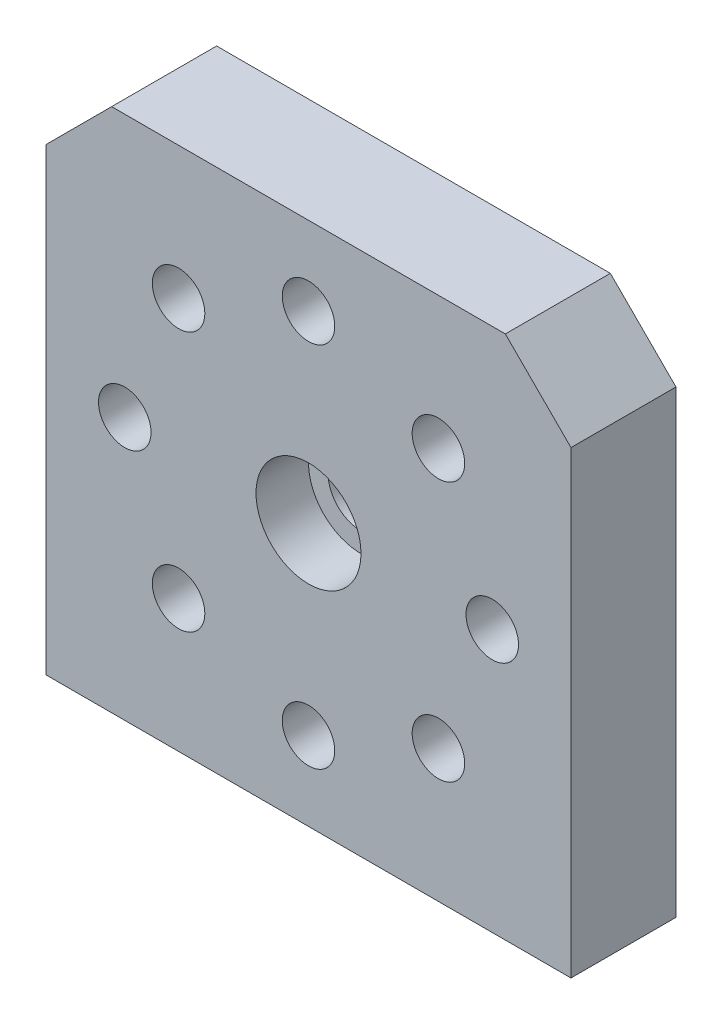
ISO-10303-21;
HEADER;
FILE_DESCRIPTION(('STEP AP214'),'2;1');
FILE_NAME('part.step','',(''),(''),'','','');
FILE_SCHEMA(('AUTOMOTIVE_DESIGN { 1 0 10303 214 1 1 1 1 }'));
ENDSEC;
DATA;
#1=APPLICATION_CONTEXT('core data for automotive mechanical design processes');
#2=APPLICATION_PROTOCOL_DEFINITION('international standard','automotive_design',2000,#1);
#3=PRODUCT_CONTEXT('',#1,'mechanical');
#4=PRODUCT('Part','Part','',(#3));
#5=PRODUCT_RELATED_PRODUCT_CATEGORY('part','',(#4));
#6=PRODUCT_DEFINITION_FORMATION('','',#4);
#7=PRODUCT_DEFINITION_CONTEXT('part definition',#1,'design');
#8=PRODUCT_DEFINITION('design','',#6,#7);
#9=PRODUCT_DEFINITION_SHAPE('','',#8);
#10=(LENGTH_UNIT() NAMED_UNIT(*) SI_UNIT(.MILLI.,.METRE.));
#11=(NAMED_UNIT(*) PLANE_ANGLE_UNIT() SI_UNIT($,.RADIAN.));
#12=(NAMED_UNIT(*) SI_UNIT($,.STERADIAN.) SOLID_ANGLE_UNIT());
#13=UNCERTAINTY_MEASURE_WITH_UNIT(LENGTH_MEASURE(1.E-05),#10,'distance_accuracy_value','');
#14=(GEOMETRIC_REPRESENTATION_CONTEXT(3) GLOBAL_UNCERTAINTY_ASSIGNED_CONTEXT((#13)) GLOBAL_UNIT_ASSIGNED_CONTEXT((#10,
#11,#12)) REPRESENTATION_CONTEXT('',''));
#15=CARTESIAN_POINT('',(0.,0.,0.));
#16=DIRECTION('',(0.,0.,1.));
#17=DIRECTION('',(1.,0.,0.));
#18=AXIS2_PLACEMENT_3D('',#15,#16,#17);
#19=CARTESIAN_POINT('',(0.,0.,8.));
#20=DIRECTION('',(0.,0.,-1.));
#21=DIRECTION('',(-1.,0.,0.));
#22=AXIS2_PLACEMENT_3D('',#19,#20,#21);
#23=CYLINDRICAL_SURFACE('',#22,2.5);
#24=CARTESIAN_POINT('',(0.,0.,0.));
#25=DIRECTION('',(0.,0.,1.));
#26=DIRECTION('',(1.,0.,0.));
#27=AXIS2_PLACEMENT_3D('',#24,#25,#26);
#28=CIRCLE('',#27,2.5);
#29=CARTESIAN_POINT('',(2.5,0.,0.));
#30=VERTEX_POINT('',#29);
#31=EDGE_CURVE('E121',#30,#30,#28,.T.);
#32=ORIENTED_EDGE('',*,*,#31,.F.);
#33=EDGE_LOOP('',(#32));
#34=FACE_BOUND('',#33,.T.);
#35=CARTESIAN_POINT('',(0.,0.,4.));
#36=DIRECTION('',(0.,0.,1.));
#37=DIRECTION('',(1.,0.,0.));
#38=AXIS2_PLACEMENT_3D('',#35,#36,#37);
#39=CIRCLE('',#38,2.5);
#40=CARTESIAN_POINT('',(2.5,0.,4.));
#41=VERTEX_POINT('',#40);
#42=EDGE_CURVE('E34',#41,#41,#39,.T.);
#43=ORIENTED_EDGE('',*,*,#42,.T.);
#44=EDGE_LOOP('',(#43));
#45=FACE_BOUND('',#44,.T.);
#46=ADVANCED_FACE('F30',(#34,#45),#23,.F.);
#47=CARTESIAN_POINT('',(-20.,-20.,8.));
#48=DIRECTION('',(0.,0.,-1.));
#49=DIRECTION('',(-1.,0.,0.));
#50=AXIS2_PLACEMENT_3D('',#47,#48,#49);
#51=PLANE('',#50);
#52=CARTESIAN_POINT('',(0.,0.,8.));
#53=DIRECTION('',(0.,0.,1.));
#54=DIRECTION('',(1.,0.,0.));
#55=AXIS2_PLACEMENT_3D('',#52,#53,#54);
#56=CIRCLE('',#55,4.);
#57=CARTESIAN_POINT('',(4.,0.,8.));
#58=VERTEX_POINT('',#57);
#59=EDGE_CURVE('E318',#58,#58,#56,.T.);
#60=ORIENTED_EDGE('',*,*,#59,.F.);
#61=EDGE_LOOP('',(#60));
#62=FACE_BOUND('',#61,.T.);
#63=CARTESIAN_POINT('',(-13.9999999999998,-2.04602083981807E-13,8.));
#64=DIRECTION('',(0.,0.,1.));
#65=DIRECTION('',(1.,0.,0.));
#66=AXIS2_PLACEMENT_3D('',#63,#64,#65);
#67=CIRCLE('',#66,2.00000000000039);
#68=CARTESIAN_POINT('',(-11.9999999999994,-2.04602083981807E-13,8.));
#69=VERTEX_POINT('',#68);
#70=EDGE_CURVE('E227',#69,#69,#67,.T.);
#71=ORIENTED_EDGE('',*,*,#70,.F.);
#72=EDGE_LOOP('',(#71));
#73=FACE_BOUND('',#72,.T.);
#74=CARTESIAN_POINT('',(3.98903336916386E-13,-14.,8.));
#75=DIRECTION('',(0.,0.,1.));
#76=DIRECTION('',(1.,0.,0.));
#77=AXIS2_PLACEMENT_3D('',#74,#75,#76);
#78=CIRCLE('',#77,2.00000000000047);
#79=CARTESIAN_POINT('',(2.00000000000087,-14.,8.));
#80=VERTEX_POINT('',#79);
#81=EDGE_CURVE('E235',#80,#80,#78,.T.);
#82=ORIENTED_EDGE('',*,*,#81,.F.);
#83=EDGE_LOOP('',(#82));
#84=FACE_BOUND('',#83,.T.);
#85=CARTESIAN_POINT('',(14.,0.,8.));
#86=DIRECTION('',(0.,0.,1.));
#87=DIRECTION('',(1.,0.,0.));
#88=AXIS2_PLACEMENT_3D('',#85,#86,#87);
#89=CIRCLE('',#88,2.);
#90=CARTESIAN_POINT('',(16.,0.,8.));
#91=VERTEX_POINT('',#90);
#92=EDGE_CURVE('E243',#91,#91,#89,.T.);
#93=ORIENTED_EDGE('',*,*,#92,.F.);
#94=EDGE_LOOP('',(#93));
#95=FACE_BOUND('',#94,.T.);
#96=CARTESIAN_POINT('',(0.,14.,8.));
#97=DIRECTION('',(0.,0.,1.));
#98=DIRECTION('',(1.,0.,0.));
#99=AXIS2_PLACEMENT_3D('',#96,#97,#98);
#100=CIRCLE('',#99,2.);
#101=CARTESIAN_POINT('',(2.,14.,8.));
#102=VERTEX_POINT('',#101);
#103=EDGE_CURVE('E190',#102,#102,#100,.T.);
#104=ORIENTED_EDGE('',*,*,#103,.F.);
#105=EDGE_LOOP('',(#104));
#106=FACE_BOUND('',#105,.T.);
#107=DIRECTION('',(1.,0.,0.));
#108=VECTOR('',#107,1.);
#109=CARTESIAN_POINT('',(20.,-20.,8.));
#110=LINE('',#109,#108);
#111=CARTESIAN_POINT('',(-20.,-20.,8.));
#112=VERTEX_POINT('',#111);
#113=CARTESIAN_POINT('',(20.,-20.,8.));
#114=VERTEX_POINT('',#113);
#115=EDGE_CURVE('E128',#112,#114,#110,.T.);
#116=ORIENTED_EDGE('',*,*,#115,.T.);
#117=DIRECTION('',(0.,1.,0.));
#118=VECTOR('',#117,1.);
#119=CARTESIAN_POINT('',(20.,15.,8.));
#120=LINE('',#119,#118);
#121=CARTESIAN_POINT('',(20.,15.,8.));
#122=VERTEX_POINT('',#121);
#123=EDGE_CURVE('E85',#114,#122,#120,.T.);
#124=ORIENTED_EDGE('',*,*,#123,.T.);
#125=DIRECTION('',(-0.707106781186548,0.707106781186548,0.));
#126=VECTOR('',#125,1.);
#127=CARTESIAN_POINT('',(15.,20.,8.));
#128=LINE('',#127,#126);
#129=CARTESIAN_POINT('',(15.,20.,8.));
#130=VERTEX_POINT('',#129);
#131=EDGE_CURVE('E99',#122,#130,#128,.T.);
#132=ORIENTED_EDGE('',*,*,#131,.T.);
#133=DIRECTION('',(-1.,0.,0.));
#134=VECTOR('',#133,1.);
#135=CARTESIAN_POINT('',(-15.,20.,8.));
#136=LINE('',#135,#134);
#137=CARTESIAN_POINT('',(-15.,20.,8.));
#138=VERTEX_POINT('',#137);
#139=EDGE_CURVE('E92',#130,#138,#136,.T.);
#140=ORIENTED_EDGE('',*,*,#139,.T.);
#141=DIRECTION('',(-0.707106781186548,-0.707106781186548,0.));
#142=VECTOR('',#141,1.);
#143=CARTESIAN_POINT('',(-15.,20.,8.));
#144=LINE('',#143,#142);
#145=CARTESIAN_POINT('',(-20.,15.,8.));
#146=VERTEX_POINT('',#145);
#147=EDGE_CURVE('E97',#138,#146,#144,.T.);
#148=ORIENTED_EDGE('',*,*,#147,.T.);
#149=DIRECTION('',(0.,-1.,0.));
#150=VECTOR('',#149,1.);
#151=CARTESIAN_POINT('',(-20.,-20.,8.));
#152=LINE('',#151,#150);
#153=EDGE_CURVE('E48',#146,#112,#152,.T.);
#154=ORIENTED_EDGE('',*,*,#153,.T.);
#155=EDGE_LOOP('',(#116,#124,#132,#140,#148,#154));
#156=FACE_BOUND('',#155,.T.);
#157=CARTESIAN_POINT('',(9.89949493661168,9.89949493661165,8.));
#158=DIRECTION('',(0.,0.,1.));
#159=DIRECTION('',(1.,0.,0.));
#160=AXIS2_PLACEMENT_3D('',#157,#158,#159);
#161=CIRCLE('',#160,2.);
#162=CARTESIAN_POINT('',(11.8994949366117,9.89949493661165,8.));
#163=VERTEX_POINT('',#162);
#164=EDGE_CURVE('E191',#163,#163,#161,.T.);
#165=ORIENTED_EDGE('',*,*,#164,.F.);
#166=EDGE_LOOP('',(#165));
#167=FACE_BOUND('',#166,.T.);
#168=CARTESIAN_POINT('',(9.899494936612,-9.89949493661153,8.));
#169=DIRECTION('',(0.,0.,1.));
#170=DIRECTION('',(1.,0.,0.));
#171=AXIS2_PLACEMENT_3D('',#168,#169,#170);
#172=CIRCLE('',#171,2.00000000000035);
#173=CARTESIAN_POINT('',(11.8994949366124,-9.89949493661153,8.));
#174=VERTEX_POINT('',#173);
#175=EDGE_CURVE('E239',#174,#174,#172,.T.);
#176=ORIENTED_EDGE('',*,*,#175,.F.);
#177=EDGE_LOOP('',(#176));
#178=FACE_BOUND('',#177,.T.);
#179=CARTESIAN_POINT('',(-9.89949493661133,-9.89949493661181,8.));
#180=DIRECTION('',(0.,0.,1.));
#181=DIRECTION('',(1.,0.,0.));
#182=AXIS2_PLACEMENT_3D('',#179,#180,#181);
#183=CIRCLE('',#182,2.00000000000049);
#184=CARTESIAN_POINT('',(-7.89949493661084,-9.89949493661181,8.));
#185=VERTEX_POINT('',#184);
#186=EDGE_CURVE('E231',#185,#185,#183,.T.);
#187=ORIENTED_EDGE('',*,*,#186,.F.);
#188=EDGE_LOOP('',(#187));
#189=FACE_BOUND('',#188,.T.);
#190=CARTESIAN_POINT('',(-9.89949493661154,9.89949493661179,8.));
#191=DIRECTION('',(0.,0.,1.));
#192=DIRECTION('',(1.,0.,0.));
#193=AXIS2_PLACEMENT_3D('',#190,#191,#192);
#194=CIRCLE('',#193,2.);
#195=CARTESIAN_POINT('',(-7.89949493661155,9.89949493661179,8.));
#196=VERTEX_POINT('',#195);
#197=EDGE_CURVE('E219',#196,#196,#194,.T.);
#198=ORIENTED_EDGE('',*,*,#197,.F.);
#199=EDGE_LOOP('',(#198));
#200=FACE_BOUND('',#199,.T.);
#201=ADVANCED_FACE('F94',(#62,#73,#84,#95,#106,#156,#167,#178,#189,#200),#51,.F.);
#202=CARTESIAN_POINT('',(-20.,-20.,0.));
#203=DIRECTION('',(0.,0.,-1.));
#204=DIRECTION('',(-1.,0.,0.));
#205=AXIS2_PLACEMENT_3D('',#202,#203,#204);
#206=PLANE('',#205);
#207=CARTESIAN_POINT('',(-13.9999999999998,-2.04602083981807E-13,0.));
#208=DIRECTION('',(0.,0.,1.));
#209=DIRECTION('',(1.,0.,0.));
#210=AXIS2_PLACEMENT_3D('',#207,#208,#209);
#211=CIRCLE('',#210,2.00000000000039);
#212=CARTESIAN_POINT('',(-11.9999999999994,-2.04602083981807E-13,0.));
#213=VERTEX_POINT('',#212);
#214=EDGE_CURVE('E177',#213,#213,#211,.T.);
#215=ORIENTED_EDGE('',*,*,#214,.T.);
#216=EDGE_LOOP('',(#215));
#217=FACE_BOUND('',#216,.T.);
#218=CARTESIAN_POINT('',(3.98903336916386E-13,-14.,0.));
#219=DIRECTION('',(0.,0.,1.));
#220=DIRECTION('',(1.,0.,0.));
#221=AXIS2_PLACEMENT_3D('',#218,#219,#220);
#222=CIRCLE('',#221,2.00000000000047);
#223=CARTESIAN_POINT('',(2.00000000000087,-14.,0.));
#224=VERTEX_POINT('',#223);
#225=EDGE_CURVE('E181',#224,#224,#222,.T.);
#226=ORIENTED_EDGE('',*,*,#225,.T.);
#227=EDGE_LOOP('',(#226));
#228=FACE_BOUND('',#227,.T.);
#229=CARTESIAN_POINT('',(14.,0.,0.));
#230=DIRECTION('',(0.,0.,1.));
#231=DIRECTION('',(1.,0.,0.));
#232=AXIS2_PLACEMENT_3D('',#229,#230,#231);
#233=CIRCLE('',#232,2.);
#234=CARTESIAN_POINT('',(16.,0.,0.));
#235=VERTEX_POINT('',#234);
#236=EDGE_CURVE('E185',#235,#235,#233,.T.);
#237=ORIENTED_EDGE('',*,*,#236,.T.);
#238=EDGE_LOOP('',(#237));
#239=FACE_BOUND('',#238,.T.);
#240=CARTESIAN_POINT('',(0.,14.,0.));
#241=DIRECTION('',(0.,0.,1.));
#242=DIRECTION('',(1.,0.,0.));
#243=AXIS2_PLACEMENT_3D('',#240,#241,#242);
#244=CIRCLE('',#243,2.);
#245=CARTESIAN_POINT('',(2.,14.,0.));
#246=VERTEX_POINT('',#245);
#247=EDGE_CURVE('E188',#246,#246,#244,.T.);
#248=ORIENTED_EDGE('',*,*,#247,.T.);
#249=EDGE_LOOP('',(#248));
#250=FACE_BOUND('',#249,.T.);
#251=DIRECTION('',(1.,0.,0.));
#252=VECTOR('',#251,1.);
#253=CARTESIAN_POINT('',(20.,-20.,0.));
#254=LINE('',#253,#252);
#255=CARTESIAN_POINT('',(-20.,-20.,0.));
#256=VERTEX_POINT('',#255);
#257=CARTESIAN_POINT('',(20.,-20.,0.));
#258=VERTEX_POINT('',#257);
#259=EDGE_CURVE('E117',#256,#258,#254,.T.);
#260=ORIENTED_EDGE('',*,*,#259,.F.);
#261=DIRECTION('',(0.,-1.,0.));
#262=VECTOR('',#261,1.);
#263=CARTESIAN_POINT('',(-20.,-20.,0.));
#264=LINE('',#263,#262);
#265=CARTESIAN_POINT('',(-20.,15.,0.));
#266=VERTEX_POINT('',#265);
#267=EDGE_CURVE('E77',#266,#256,#264,.T.);
#268=ORIENTED_EDGE('',*,*,#267,.F.);
#269=DIRECTION('',(-0.707106781186548,-0.707106781186548,0.));
#270=VECTOR('',#269,1.);
#271=CARTESIAN_POINT('',(-15.,20.,0.));
#272=LINE('',#271,#270);
#273=CARTESIAN_POINT('',(-15.,20.,0.));
#274=VERTEX_POINT('',#273);
#275=EDGE_CURVE('E71',#274,#266,#272,.T.);
#276=ORIENTED_EDGE('',*,*,#275,.F.);
#277=DIRECTION('',(-1.,0.,0.));
#278=VECTOR('',#277,1.);
#279=CARTESIAN_POINT('',(-15.,20.,0.));
#280=LINE('',#279,#278);
#281=CARTESIAN_POINT('',(15.,20.,0.));
#282=VERTEX_POINT('',#281);
#283=EDGE_CURVE('E107',#282,#274,#280,.T.);
#284=ORIENTED_EDGE('',*,*,#283,.F.);
#285=DIRECTION('',(-0.707106781186548,0.707106781186548,0.));
#286=VECTOR('',#285,1.);
#287=CARTESIAN_POINT('',(15.,20.,0.));
#288=LINE('',#287,#286);
#289=CARTESIAN_POINT('',(20.,15.,0.));
#290=VERTEX_POINT('',#289);
#291=EDGE_CURVE('E123',#290,#282,#288,.T.);
#292=ORIENTED_EDGE('',*,*,#291,.F.);
#293=DIRECTION('',(0.,1.,0.));
#294=VECTOR('',#293,1.);
#295=CARTESIAN_POINT('',(20.,15.,0.));
#296=LINE('',#295,#294);
#297=EDGE_CURVE('E120',#258,#290,#296,.T.);
#298=ORIENTED_EDGE('',*,*,#297,.F.);
#299=EDGE_LOOP('',(#260,#268,#276,#284,#292,#298));
#300=FACE_BOUND('',#299,.T.);
#301=ORIENTED_EDGE('',*,*,#31,.T.);
#302=EDGE_LOOP('',(#301));
#303=FACE_BOUND('',#302,.T.);
#304=CARTESIAN_POINT('',(9.89949493661168,9.89949493661165,0.));
#305=DIRECTION('',(0.,0.,1.));
#306=DIRECTION('',(1.,0.,0.));
#307=AXIS2_PLACEMENT_3D('',#304,#305,#306);
#308=CIRCLE('',#307,2.);
#309=CARTESIAN_POINT('',(11.8994949366117,9.89949493661165,0.));
#310=VERTEX_POINT('',#309);
#311=EDGE_CURVE('E196',#310,#310,#308,.T.);
#312=ORIENTED_EDGE('',*,*,#311,.T.);
#313=EDGE_LOOP('',(#312));
#314=FACE_BOUND('',#313,.T.);
#315=CARTESIAN_POINT('',(9.899494936612,-9.89949493661153,0.));
#316=DIRECTION('',(0.,0.,1.));
#317=DIRECTION('',(1.,0.,0.));
#318=AXIS2_PLACEMENT_3D('',#315,#316,#317);
#319=CIRCLE('',#318,2.00000000000035);
#320=CARTESIAN_POINT('',(11.8994949366124,-9.89949493661153,0.));
#321=VERTEX_POINT('',#320);
#322=EDGE_CURVE('E210',#321,#321,#319,.T.);
#323=ORIENTED_EDGE('',*,*,#322,.T.);
#324=EDGE_LOOP('',(#323));
#325=FACE_BOUND('',#324,.T.);
#326=CARTESIAN_POINT('',(-9.89949493661133,-9.89949493661181,0.));
#327=DIRECTION('',(0.,0.,1.));
#328=DIRECTION('',(1.,0.,0.));
#329=AXIS2_PLACEMENT_3D('',#326,#327,#328);
#330=CIRCLE('',#329,2.00000000000049);
#331=CARTESIAN_POINT('',(-7.89949493661084,-9.89949493661181,0.));
#332=VERTEX_POINT('',#331);
#333=EDGE_CURVE('E214',#332,#332,#330,.T.);
#334=ORIENTED_EDGE('',*,*,#333,.T.);
#335=EDGE_LOOP('',(#334));
#336=FACE_BOUND('',#335,.T.);
#337=CARTESIAN_POINT('',(-9.89949493661154,9.89949493661179,0.));
#338=DIRECTION('',(0.,0.,1.));
#339=DIRECTION('',(1.,0.,0.));
#340=AXIS2_PLACEMENT_3D('',#337,#338,#339);
#341=CIRCLE('',#340,2.);
#342=CARTESIAN_POINT('',(-7.89949493661155,9.89949493661179,0.));
#343=VERTEX_POINT('',#342);
#344=EDGE_CURVE('E217',#343,#343,#341,.T.);
#345=ORIENTED_EDGE('',*,*,#344,.T.);
#346=EDGE_LOOP('',(#345));
#347=FACE_BOUND('',#346,.T.);
#348=ADVANCED_FACE('F138',(#217,#228,#239,#250,#300,#303,#314,#325,#336,#347),#206,.T.);
#349=CARTESIAN_POINT('',(20.,-20.,8.));
#350=DIRECTION('',(0.,1.,0.));
#351=DIRECTION('',(-1.,0.,0.));
#352=AXIS2_PLACEMENT_3D('',#349,#350,#351);
#353=PLANE('',#352);
#354=CARTESIAN_POINT('',(15.5,-20.,4.));
#355=DIRECTION('',(0.,-1.,0.));
#356=DIRECTION('',(1.,0.,0.));
#357=AXIS2_PLACEMENT_3D('',#354,#355,#356);
#358=CIRCLE('',#357,2.);
#359=CARTESIAN_POINT('',(17.5,-20.,4.));
#360=VERTEX_POINT('',#359);
#361=EDGE_CURVE('E309',#360,#360,#358,.T.);
#362=ORIENTED_EDGE('',*,*,#361,.F.);
#363=EDGE_LOOP('',(#362));
#364=FACE_BOUND('',#363,.T.);
#365=CARTESIAN_POINT('',(-15.5,-20.,4.));
#366=DIRECTION('',(0.,-1.,0.));
#367=DIRECTION('',(1.,0.,0.));
#368=AXIS2_PLACEMENT_3D('',#365,#366,#367);
#369=CIRCLE('',#368,2.);
#370=CARTESIAN_POINT('',(-13.5,-20.,4.));
#371=VERTEX_POINT('',#370);
#372=EDGE_CURVE('E308',#371,#371,#369,.T.);
#373=ORIENTED_EDGE('',*,*,#372,.F.);
#374=EDGE_LOOP('',(#373));
#375=FACE_BOUND('',#374,.T.);
#376=ORIENTED_EDGE('',*,*,#259,.T.);
#377=DIRECTION('',(0.,0.,-1.));
#378=VECTOR('',#377,1.);
#379=CARTESIAN_POINT('',(20.,-20.,8.));
#380=LINE('',#379,#378);
#381=EDGE_CURVE('E11',#114,#258,#380,.T.);
#382=ORIENTED_EDGE('',*,*,#381,.F.);
#383=ORIENTED_EDGE('',*,*,#115,.F.);
#384=DIRECTION('',(0.,0.,-1.));
#385=VECTOR('',#384,1.);
#386=CARTESIAN_POINT('',(-20.,-20.,8.));
#387=LINE('',#386,#385);
#388=EDGE_CURVE('E113',#112,#256,#387,.T.);
#389=ORIENTED_EDGE('',*,*,#388,.T.);
#390=EDGE_LOOP('',(#376,#382,#383,#389));
#391=FACE_BOUND('',#390,.T.);
#392=ADVANCED_FACE('F32',(#364,#375,#391),#353,.F.);
#393=CARTESIAN_POINT('',(20.,15.,8.));
#394=DIRECTION('',(-1.,0.,0.));
#395=DIRECTION('',(0.,-1.,0.));
#396=AXIS2_PLACEMENT_3D('',#393,#394,#395);
#397=PLANE('',#396);
#398=ORIENTED_EDGE('',*,*,#297,.T.);
#399=DIRECTION('',(0.,0.,-1.));
#400=VECTOR('',#399,1.);
#401=CARTESIAN_POINT('',(20.,15.,8.));
#402=LINE('',#401,#400);
#403=EDGE_CURVE('E40',#122,#290,#402,.T.);
#404=ORIENTED_EDGE('',*,*,#403,.F.);
#405=ORIENTED_EDGE('',*,*,#123,.F.);
#406=ORIENTED_EDGE('',*,*,#381,.T.);
#407=EDGE_LOOP('',(#398,#404,#405,#406));
#408=FACE_BOUND('',#407,.T.);
#409=ADVANCED_FACE('F172',(#408),#397,.F.);
#410=CARTESIAN_POINT('',(15.,20.,8.));
#411=DIRECTION('',(-0.707106781186547,-0.707106781186547,0.));
#412=DIRECTION('',(0.707106781186548,-0.707106781186548,0.));
#413=AXIS2_PLACEMENT_3D('',#410,#411,#412);
#414=PLANE('',#413);
#415=ORIENTED_EDGE('',*,*,#291,.T.);
#416=DIRECTION('',(0.,0.,-1.));
#417=VECTOR('',#416,1.);
#418=CARTESIAN_POINT('',(15.,20.,8.));
#419=LINE('',#418,#417);
#420=EDGE_CURVE('E108',#130,#282,#419,.T.);
#421=ORIENTED_EDGE('',*,*,#420,.F.);
#422=ORIENTED_EDGE('',*,*,#131,.F.);
#423=ORIENTED_EDGE('',*,*,#403,.T.);
#424=EDGE_LOOP('',(#415,#421,#422,#423));
#425=FACE_BOUND('',#424,.T.);
#426=ADVANCED_FACE('F135',(#425),#414,.F.);
#427=CARTESIAN_POINT('',(-15.,20.,8.));
#428=DIRECTION('',(0.,-1.,0.));
#429=DIRECTION('',(1.,0.,0.));
#430=AXIS2_PLACEMENT_3D('',#427,#428,#429);
#431=PLANE('',#430);
#432=ORIENTED_EDGE('',*,*,#283,.T.);
#433=DIRECTION('',(0.,0.,-1.));
#434=VECTOR('',#433,1.);
#435=CARTESIAN_POINT('',(-15.,20.,8.));
#436=LINE('',#435,#434);
#437=EDGE_CURVE('E104',#138,#274,#436,.T.);
#438=ORIENTED_EDGE('',*,*,#437,.F.);
#439=ORIENTED_EDGE('',*,*,#139,.F.);
#440=ORIENTED_EDGE('',*,*,#420,.T.);
#441=EDGE_LOOP('',(#432,#438,#439,#440));
#442=FACE_BOUND('',#441,.T.);
#443=ADVANCED_FACE('F105',(#442),#431,.F.);
#444=CARTESIAN_POINT('',(-15.,20.,8.));
#445=DIRECTION('',(0.707106781186547,-0.707106781186547,0.));
#446=DIRECTION('',(0.707106781186548,0.707106781186548,0.));
#447=AXIS2_PLACEMENT_3D('',#444,#445,#446);
#448=PLANE('',#447);
#449=ORIENTED_EDGE('',*,*,#275,.T.);
#450=DIRECTION('',(0.,0.,-1.));
#451=VECTOR('',#450,1.);
#452=CARTESIAN_POINT('',(-20.,15.,8.));
#453=LINE('',#452,#451);
#454=EDGE_CURVE('E109',#146,#266,#453,.T.);
#455=ORIENTED_EDGE('',*,*,#454,.F.);
#456=ORIENTED_EDGE('',*,*,#147,.F.);
#457=ORIENTED_EDGE('',*,*,#437,.T.);
#458=EDGE_LOOP('',(#449,#455,#456,#457));
#459=FACE_BOUND('',#458,.T.);
#460=ADVANCED_FACE('F111',(#459),#448,.F.);
#461=CARTESIAN_POINT('',(-20.,-20.,8.));
#462=DIRECTION('',(1.,0.,0.));
#463=DIRECTION('',(0.,1.,0.));
#464=AXIS2_PLACEMENT_3D('',#461,#462,#463);
#465=PLANE('',#464);
#466=ORIENTED_EDGE('',*,*,#267,.T.);
#467=ORIENTED_EDGE('',*,*,#388,.F.);
#468=ORIENTED_EDGE('',*,*,#153,.F.);
#469=ORIENTED_EDGE('',*,*,#454,.T.);
#470=EDGE_LOOP('',(#466,#467,#468,#469));
#471=FACE_BOUND('',#470,.T.);
#472=ADVANCED_FACE('F143',(#471),#465,.F.);
#473=CARTESIAN_POINT('',(0.,14.,8.));
#474=DIRECTION('',(0.,0.,-1.));
#475=DIRECTION('',(-1.,0.,0.));
#476=AXIS2_PLACEMENT_3D('',#473,#474,#475);
#477=CYLINDRICAL_SURFACE('',#476,2.);
#478=ORIENTED_EDGE('',*,*,#103,.T.);
#479=EDGE_LOOP('',(#478));
#480=FACE_BOUND('',#479,.T.);
#481=ORIENTED_EDGE('',*,*,#247,.F.);
#482=EDGE_LOOP('',(#481));
#483=FACE_BOUND('',#482,.T.);
#484=ADVANCED_FACE('F145',(#480,#483),#477,.F.);
#485=CARTESIAN_POINT('',(9.89949493661168,9.89949493661165,8.));
#486=DIRECTION('',(0.,0.,-1.));
#487=DIRECTION('',(-1.,0.,0.));
#488=AXIS2_PLACEMENT_3D('',#485,#486,#487);
#489=CYLINDRICAL_SURFACE('',#488,2.);
#490=ORIENTED_EDGE('',*,*,#164,.T.);
#491=EDGE_LOOP('',(#490));
#492=FACE_BOUND('',#491,.T.);
#493=ORIENTED_EDGE('',*,*,#311,.F.);
#494=EDGE_LOOP('',(#493));
#495=FACE_BOUND('',#494,.T.);
#496=ADVANCED_FACE('F151',(#492,#495),#489,.F.);
#497=CARTESIAN_POINT('',(14.,0.,8.));
#498=DIRECTION('',(0.,0.,-1.));
#499=DIRECTION('',(-1.,0.,0.));
#500=AXIS2_PLACEMENT_3D('',#497,#498,#499);
#501=CYLINDRICAL_SURFACE('',#500,2.);
#502=ORIENTED_EDGE('',*,*,#92,.T.);
#503=EDGE_LOOP('',(#502));
#504=FACE_BOUND('',#503,.T.);
#505=ORIENTED_EDGE('',*,*,#236,.F.);
#506=EDGE_LOOP('',(#505));
#507=FACE_BOUND('',#506,.T.);
#508=ADVANCED_FACE('F248',(#504,#507),#501,.F.);
#509=CARTESIAN_POINT('',(9.899494936612,-9.89949493661153,8.));
#510=DIRECTION('',(0.,0.,-1.));
#511=DIRECTION('',(-1.,0.,0.));
#512=AXIS2_PLACEMENT_3D('',#509,#510,#511);
#513=CYLINDRICAL_SURFACE('',#512,2.00000000000035);
#514=ORIENTED_EDGE('',*,*,#175,.T.);
#515=EDGE_LOOP('',(#514));
#516=FACE_BOUND('',#515,.T.);
#517=ORIENTED_EDGE('',*,*,#322,.F.);
#518=EDGE_LOOP('',(#517));
#519=FACE_BOUND('',#518,.T.);
#520=ADVANCED_FACE('F254',(#516,#519),#513,.F.);
#521=CARTESIAN_POINT('',(3.98903336916386E-13,-14.,8.));
#522=DIRECTION('',(0.,0.,-1.));
#523=DIRECTION('',(-1.,0.,0.));
#524=AXIS2_PLACEMENT_3D('',#521,#522,#523);
#525=CYLINDRICAL_SURFACE('',#524,2.00000000000047);
#526=ORIENTED_EDGE('',*,*,#81,.T.);
#527=EDGE_LOOP('',(#526));
#528=FACE_BOUND('',#527,.T.);
#529=ORIENTED_EDGE('',*,*,#225,.F.);
#530=EDGE_LOOP('',(#529));
#531=FACE_BOUND('',#530,.T.);
#532=ADVANCED_FACE('F260',(#528,#531),#525,.F.);
#533=CARTESIAN_POINT('',(-9.89949493661133,-9.89949493661181,8.));
#534=DIRECTION('',(0.,0.,-1.));
#535=DIRECTION('',(-1.,0.,0.));
#536=AXIS2_PLACEMENT_3D('',#533,#534,#535);
#537=CYLINDRICAL_SURFACE('',#536,2.00000000000049);
#538=ORIENTED_EDGE('',*,*,#186,.T.);
#539=EDGE_LOOP('',(#538));
#540=FACE_BOUND('',#539,.T.);
#541=ORIENTED_EDGE('',*,*,#333,.F.);
#542=EDGE_LOOP('',(#541));
#543=FACE_BOUND('',#542,.T.);
#544=ADVANCED_FACE('F267',(#540,#543),#537,.F.);
#545=CARTESIAN_POINT('',(-13.9999999999998,-2.04602083981807E-13,8.));
#546=DIRECTION('',(0.,0.,-1.));
#547=DIRECTION('',(-1.,0.,0.));
#548=AXIS2_PLACEMENT_3D('',#545,#546,#547);
#549=CYLINDRICAL_SURFACE('',#548,2.00000000000039);
#550=ORIENTED_EDGE('',*,*,#70,.T.);
#551=EDGE_LOOP('',(#550));
#552=FACE_BOUND('',#551,.T.);
#553=ORIENTED_EDGE('',*,*,#214,.F.);
#554=EDGE_LOOP('',(#553));
#555=FACE_BOUND('',#554,.T.);
#556=ADVANCED_FACE('F271',(#552,#555),#549,.F.);
#557=CARTESIAN_POINT('',(-9.89949493661154,9.89949493661179,8.));
#558=DIRECTION('',(0.,0.,-1.));
#559=DIRECTION('',(-1.,0.,0.));
#560=AXIS2_PLACEMENT_3D('',#557,#558,#559);
#561=CYLINDRICAL_SURFACE('',#560,2.);
#562=ORIENTED_EDGE('',*,*,#197,.T.);
#563=EDGE_LOOP('',(#562));
#564=FACE_BOUND('',#563,.T.);
#565=ORIENTED_EDGE('',*,*,#344,.F.);
#566=EDGE_LOOP('',(#565));
#567=FACE_BOUND('',#566,.T.);
#568=ADVANCED_FACE('F275',(#564,#567),#561,.F.);
#569=CARTESIAN_POINT('',(0.,0.,4.));
#570=DIRECTION('',(0.,0.,1.));
#571=DIRECTION('',(1.,0.,0.));
#572=AXIS2_PLACEMENT_3D('',#569,#570,#571);
#573=CYLINDRICAL_SURFACE('',#572,4.);
#574=CARTESIAN_POINT('',(0.,0.,4.));
#575=DIRECTION('',(0.,0.,1.));
#576=DIRECTION('',(1.,0.,0.));
#577=AXIS2_PLACEMENT_3D('',#574,#575,#576);
#578=CIRCLE('',#577,4.);
#579=CARTESIAN_POINT('',(4.,0.,4.));
#580=VERTEX_POINT('',#579);
#581=EDGE_CURVE('E224',#580,#580,#578,.T.);
#582=ORIENTED_EDGE('',*,*,#581,.F.);
#583=EDGE_LOOP('',(#582));
#584=FACE_BOUND('',#583,.T.);
#585=ORIENTED_EDGE('',*,*,#59,.T.);
#586=EDGE_LOOP('',(#585));
#587=FACE_BOUND('',#586,.T.);
#588=ADVANCED_FACE('F279',(#584,#587),#573,.F.);
#589=CARTESIAN_POINT('',(0.,0.,4.));
#590=DIRECTION('',(0.,0.,1.));
#591=DIRECTION('',(1.,0.,0.));
#592=AXIS2_PLACEMENT_3D('',#589,#590,#591);
#593=PLANE('',#592);
#594=ORIENTED_EDGE('',*,*,#42,.F.);
#595=EDGE_LOOP('',(#594));
#596=FACE_BOUND('',#595,.T.);
#597=ORIENTED_EDGE('',*,*,#581,.T.);
#598=EDGE_LOOP('',(#597));
#599=FACE_BOUND('',#598,.T.);
#600=ADVANCED_FACE('F283',(#596,#599),#593,.T.);
#601=CARTESIAN_POINT('',(-15.5,-5.,4.));
#602=DIRECTION('',(0.,-1.,0.));
#603=DIRECTION('',(1.,0.,0.));
#604=AXIS2_PLACEMENT_3D('',#601,#602,#603);
#605=CYLINDRICAL_SURFACE('',#604,2.);
#606=CARTESIAN_POINT('',(-15.5,-5.,4.));
#607=DIRECTION('',(0.,-1.,0.));
#608=DIRECTION('',(1.,0.,0.));
#609=AXIS2_PLACEMENT_3D('',#606,#607,#608);
#610=CIRCLE('',#609,2.);
#611=CARTESIAN_POINT('',(-13.5,-5.,4.));
#612=VERTEX_POINT('',#611);
#613=EDGE_CURVE('E312',#612,#612,#610,.T.);
#614=ORIENTED_EDGE('',*,*,#613,.F.);
#615=EDGE_LOOP('',(#614));
#616=FACE_BOUND('',#615,.T.);
#617=ORIENTED_EDGE('',*,*,#372,.T.);
#618=EDGE_LOOP('',(#617));
#619=FACE_BOUND('',#618,.T.);
#620=ADVANCED_FACE('F287',(#616,#619),#605,.F.);
#621=CARTESIAN_POINT('',(-15.5,-5.,4.));
#622=DIRECTION('',(0.,-1.,0.));
#623=DIRECTION('',(1.,0.,0.));
#624=AXIS2_PLACEMENT_3D('',#621,#622,#623);
#625=PLANE('',#624);
#626=ORIENTED_EDGE('',*,*,#613,.T.);
#627=EDGE_LOOP('',(#626));
#628=FACE_BOUND('',#627,.T.);
#629=ADVANCED_FACE('F291',(#628),#625,.T.);
#630=CARTESIAN_POINT('',(15.5,-5.,4.));
#631=DIRECTION('',(0.,-1.,0.));
#632=DIRECTION('',(1.,0.,0.));
#633=AXIS2_PLACEMENT_3D('',#630,#631,#632);
#634=CYLINDRICAL_SURFACE('',#633,2.);
#635=CARTESIAN_POINT('',(15.5,-5.,4.));
#636=DIRECTION('',(0.,-1.,0.));
#637=DIRECTION('',(1.,0.,0.));
#638=AXIS2_PLACEMENT_3D('',#635,#636,#637);
#639=CIRCLE('',#638,2.);
#640=CARTESIAN_POINT('',(17.5,-5.,4.));
#641=VERTEX_POINT('',#640);
#642=EDGE_CURVE('E307',#641,#641,#639,.T.);
#643=ORIENTED_EDGE('',*,*,#642,.F.);
#644=EDGE_LOOP('',(#643));
#645=FACE_BOUND('',#644,.T.);
#646=ORIENTED_EDGE('',*,*,#361,.T.);
#647=EDGE_LOOP('',(#646));
#648=FACE_BOUND('',#647,.T.);
#649=ADVANCED_FACE('F295',(#645,#648),#634,.F.);
#650=CARTESIAN_POINT('',(15.5,-5.,4.));
#651=DIRECTION('',(0.,-1.,0.));
#652=DIRECTION('',(1.,0.,0.));
#653=AXIS2_PLACEMENT_3D('',#650,#651,#652);
#654=PLANE('',#653);
#655=ORIENTED_EDGE('',*,*,#642,.T.);
#656=EDGE_LOOP('',(#655));
#657=FACE_BOUND('',#656,.T.);
#658=ADVANCED_FACE('F299',(#657),#654,.T.);
#659=CLOSED_SHELL('',(#46,#201,#348,#392,#409,#426,#443,#460,#472,#484,#496,#508,#520,#532,#544,
#556,#568,#588,#600,#620,#629,#649,#658));
#660=MANIFOLD_SOLID_BREP('B2',#659);
#661=ADVANCED_BREP_SHAPE_REPRESENTATION('',(#18,#660),#14);
#662=SHAPE_DEFINITION_REPRESENTATION(#9,#661);
ENDSEC;
END-ISO-10303-21;
